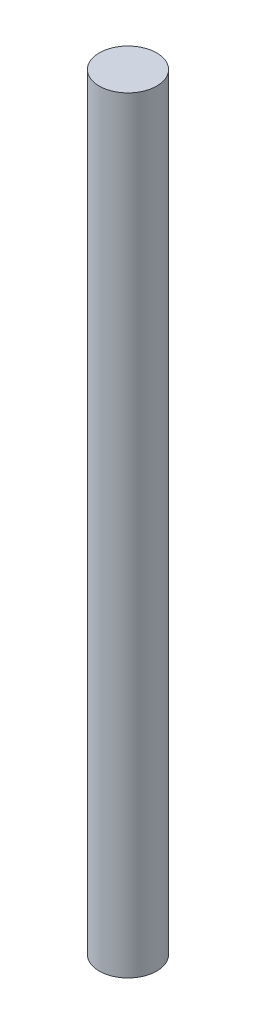
ISO-10303-21;
HEADER;
FILE_DESCRIPTION(('STEP AP214'),'2;1');
FILE_NAME('part.step','',(''),(''),'','','');
FILE_SCHEMA(('AUTOMOTIVE_DESIGN { 1 0 10303 214 1 1 1 1 }'));
ENDSEC;
DATA;
#1=APPLICATION_CONTEXT('core data for automotive mechanical design processes');
#2=APPLICATION_PROTOCOL_DEFINITION('international standard','automotive_design',2000,#1);
#3=PRODUCT_CONTEXT('',#1,'mechanical');
#4=PRODUCT('Part','Part','',(#3));
#5=PRODUCT_RELATED_PRODUCT_CATEGORY('part','',(#4));
#6=PRODUCT_DEFINITION_FORMATION('','',#4);
#7=PRODUCT_DEFINITION_CONTEXT('part definition',#1,'design');
#8=PRODUCT_DEFINITION('design','',#6,#7);
#9=PRODUCT_DEFINITION_SHAPE('','',#8);
#10=(LENGTH_UNIT() NAMED_UNIT(*) SI_UNIT(.MILLI.,.METRE.));
#11=(NAMED_UNIT(*) PLANE_ANGLE_UNIT() SI_UNIT($,.RADIAN.));
#12=(NAMED_UNIT(*) SI_UNIT($,.STERADIAN.) SOLID_ANGLE_UNIT());
#13=UNCERTAINTY_MEASURE_WITH_UNIT(LENGTH_MEASURE(1.E-05),#10,'distance_accuracy_value','');
#14=(GEOMETRIC_REPRESENTATION_CONTEXT(3) GLOBAL_UNCERTAINTY_ASSIGNED_CONTEXT((#13)) GLOBAL_UNIT_ASSIGNED_CONTEXT((#10,
#11,#12)) REPRESENTATION_CONTEXT('',''));
#15=CARTESIAN_POINT('',(0.,0.,0.));
#16=DIRECTION('',(0.,0.,1.));
#17=DIRECTION('',(1.,0.,0.));
#18=AXIS2_PLACEMENT_3D('',#15,#16,#17);
#19=CARTESIAN_POINT('',(0.,127.,0.));
#20=DIRECTION('',(0.,-1.,0.));
#21=DIRECTION('',(0.,0.,-1.));
#22=AXIS2_PLACEMENT_3D('',#19,#20,#21);
#23=CYLINDRICAL_SURFACE('',#22,4.7625);
#24=CARTESIAN_POINT('',(0.,127.,0.));
#25=DIRECTION('',(0.,1.,0.));
#26=DIRECTION('',(0.,0.,1.));
#27=AXIS2_PLACEMENT_3D('',#24,#25,#26);
#28=CIRCLE('',#27,4.7625);
#29=CARTESIAN_POINT('',(0.,127.,4.7625));
#30=VERTEX_POINT('',#29);
#31=EDGE_CURVE('E10',#30,#30,#28,.T.);
#32=ORIENTED_EDGE('',*,*,#31,.F.);
#33=EDGE_LOOP('',(#32));
#34=FACE_BOUND('',#33,.T.);
#35=CARTESIAN_POINT('',(0.,0.,0.));
#36=DIRECTION('',(0.,1.,0.));
#37=DIRECTION('',(0.,0.,1.));
#38=AXIS2_PLACEMENT_3D('',#35,#36,#37);
#39=CIRCLE('',#38,4.7625);
#40=CARTESIAN_POINT('',(0.,0.,4.7625));
#41=VERTEX_POINT('',#40);
#42=EDGE_CURVE('E34',#41,#41,#39,.T.);
#43=ORIENTED_EDGE('',*,*,#42,.T.);
#44=EDGE_LOOP('',(#43));
#45=FACE_BOUND('',#44,.T.);
#46=ADVANCED_FACE('F31',(#34,#45),#23,.T.);
#47=CARTESIAN_POINT('',(0.,127.,0.));
#48=DIRECTION('',(0.,1.,0.));
#49=DIRECTION('',(0.,0.,1.));
#50=AXIS2_PLACEMENT_3D('',#47,#48,#49);
#51=PLANE('',#50);
#52=ORIENTED_EDGE('',*,*,#31,.T.);
#53=EDGE_LOOP('',(#52));
#54=FACE_BOUND('',#53,.T.);
#55=ADVANCED_FACE('F46',(#54),#51,.T.);
#56=CARTESIAN_POINT('',(0.,0.,0.));
#57=DIRECTION('',(0.,1.,0.));
#58=DIRECTION('',(0.,0.,1.));
#59=AXIS2_PLACEMENT_3D('',#56,#57,#58);
#60=PLANE('',#59);
#61=ORIENTED_EDGE('',*,*,#42,.F.);
#62=EDGE_LOOP('',(#61));
#63=FACE_BOUND('',#62,.T.);
#64=ADVANCED_FACE('F44',(#63),#60,.F.);
#65=CLOSED_SHELL('',(#46,#55,#64));
#66=MANIFOLD_SOLID_BREP('B2',#65);
#67=ADVANCED_BREP_SHAPE_REPRESENTATION('',(#18,#66),#14);
#68=SHAPE_DEFINITION_REPRESENTATION(#9,#67);
ENDSEC;
END-ISO-10303-21;
